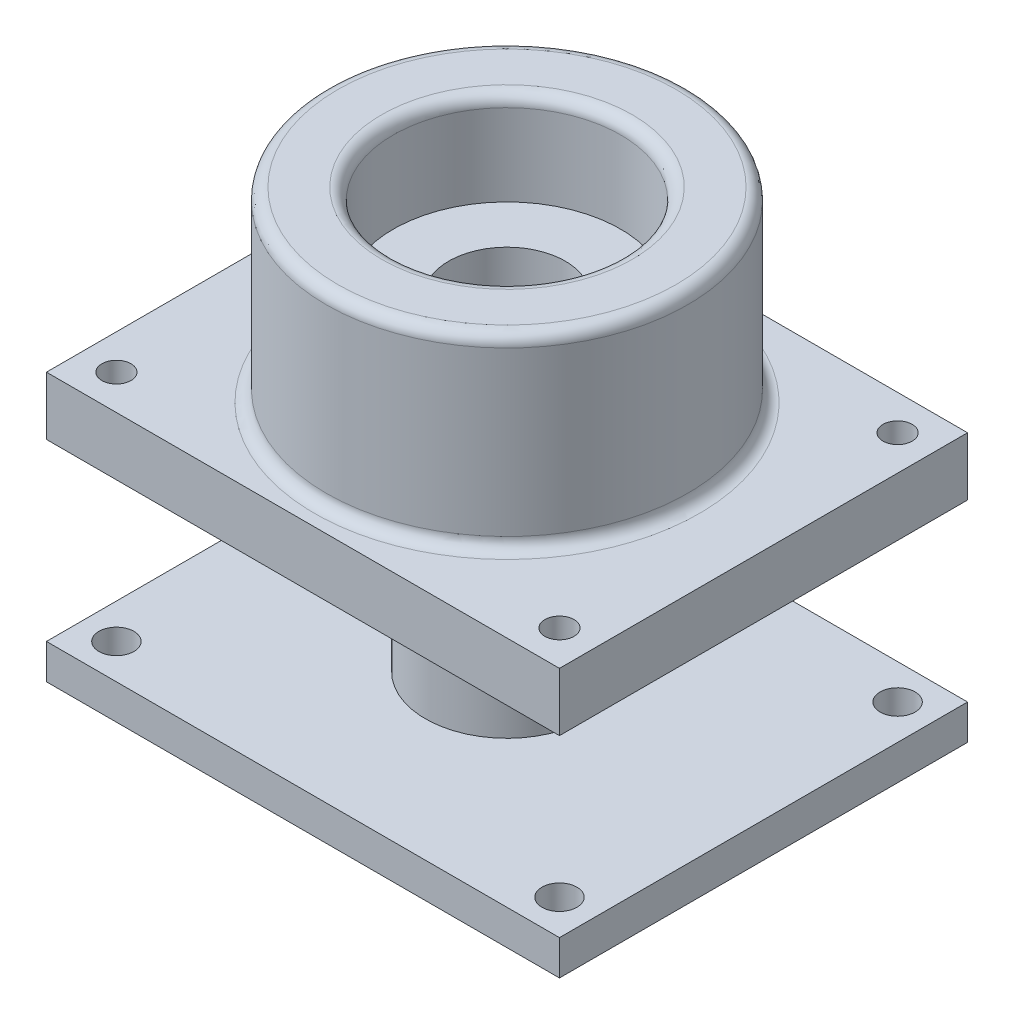
ISO-10303-21;
HEADER;
FILE_DESCRIPTION(('STEP AP214'),'2;1');
FILE_NAME('part.step','',(''),(''),'','','');
FILE_SCHEMA(('AUTOMOTIVE_DESIGN { 1 0 10303 214 1 1 1 1 }'));
ENDSEC;
DATA;
#1=APPLICATION_CONTEXT('core data for automotive mechanical design processes');
#2=APPLICATION_PROTOCOL_DEFINITION('international standard','automotive_design',2000,#1);
#3=PRODUCT_CONTEXT('',#1,'mechanical');
#4=PRODUCT('Part','Part','',(#3));
#5=PRODUCT_RELATED_PRODUCT_CATEGORY('part','',(#4));
#6=PRODUCT_DEFINITION_FORMATION('','',#4);
#7=PRODUCT_DEFINITION_CONTEXT('part definition',#1,'design');
#8=PRODUCT_DEFINITION('design','',#6,#7);
#9=PRODUCT_DEFINITION_SHAPE('','',#8);
#10=(LENGTH_UNIT() NAMED_UNIT(*) SI_UNIT(.MILLI.,.METRE.));
#11=(NAMED_UNIT(*) PLANE_ANGLE_UNIT() SI_UNIT($,.RADIAN.));
#12=(NAMED_UNIT(*) SI_UNIT($,.STERADIAN.) SOLID_ANGLE_UNIT());
#13=UNCERTAINTY_MEASURE_WITH_UNIT(LENGTH_MEASURE(1.E-05),#10,'distance_accuracy_value','');
#14=(GEOMETRIC_REPRESENTATION_CONTEXT(3) GLOBAL_UNCERTAINTY_ASSIGNED_CONTEXT((#13)) GLOBAL_UNIT_ASSIGNED_CONTEXT((#10,
#11,#12)) REPRESENTATION_CONTEXT('',''));
#15=CARTESIAN_POINT('',(0.,0.,0.));
#16=DIRECTION('',(0.,0.,1.));
#17=DIRECTION('',(1.,0.,0.));
#18=AXIS2_PLACEMENT_3D('',#15,#16,#17);
#19=CARTESIAN_POINT('',(0.,16.,0.));
#20=DIRECTION('',(0.,-1.,0.));
#21=DIRECTION('',(0.,0.,-1.));
#22=AXIS2_PLACEMENT_3D('',#19,#20,#21);
#23=CYLINDRICAL_SURFACE('',#22,15.5);
#24=CARTESIAN_POINT('',(0.,15.,0.));
#25=DIRECTION('',(0.,1.,0.));
#26=DIRECTION('',(0.,0.,1.));
#27=AXIS2_PLACEMENT_3D('',#24,#25,#26);
#28=CIRCLE('',#27,15.5);
#29=CARTESIAN_POINT('',(0.,15.,15.5));
#30=VERTEX_POINT('',#29);
#31=EDGE_CURVE('E11',#30,#30,#28,.F.);
#32=ORIENTED_EDGE('',*,*,#31,.T.);
#33=EDGE_LOOP('',(#32));
#34=FACE_BOUND('',#33,.T.);
#35=CARTESIAN_POINT('',(0.,1.,0.));
#36=DIRECTION('',(0.,-1.,0.));
#37=DIRECTION('',(0.,0.,-1.));
#38=AXIS2_PLACEMENT_3D('',#35,#36,#37);
#39=CIRCLE('',#38,15.5);
#40=CARTESIAN_POINT('',(0.,1.,-15.5));
#41=VERTEX_POINT('',#40);
#42=EDGE_CURVE('E210',#41,#41,#39,.F.);
#43=ORIENTED_EDGE('',*,*,#42,.T.);
#44=EDGE_LOOP('',(#43));
#45=FACE_BOUND('',#44,.T.);
#46=ADVANCED_FACE('F35',(#34,#45),#23,.T.);
#47=CARTESIAN_POINT('',(0.,16.,0.));
#48=DIRECTION('',(0.,1.,0.));
#49=DIRECTION('',(0.,0.,1.));
#50=AXIS2_PLACEMENT_3D('',#47,#48,#49);
#51=PLANE('',#50);
#52=CARTESIAN_POINT('',(0.,16.,0.));
#53=DIRECTION('',(0.,1.,0.));
#54=DIRECTION('',(0.,0.,1.));
#55=AXIS2_PLACEMENT_3D('',#52,#53,#54);
#56=CIRCLE('',#55,14.5);
#57=CARTESIAN_POINT('',(0.,16.,14.5));
#58=VERTEX_POINT('',#57);
#59=EDGE_CURVE('E45',#58,#58,#56,.T.);
#60=ORIENTED_EDGE('',*,*,#59,.T.);
#61=EDGE_LOOP('',(#60));
#62=FACE_BOUND('',#61,.T.);
#63=CARTESIAN_POINT('',(0.,16.,0.));
#64=DIRECTION('',(0.,1.,0.));
#65=DIRECTION('',(0.,0.,1.));
#66=AXIS2_PLACEMENT_3D('',#63,#64,#65);
#67=CIRCLE('',#66,10.75);
#68=CARTESIAN_POINT('',(0.,16.,10.75));
#69=VERTEX_POINT('',#68);
#70=EDGE_CURVE('E219',#69,#69,#67,.F.);
#71=ORIENTED_EDGE('',*,*,#70,.T.);
#72=EDGE_LOOP('',(#71));
#73=FACE_BOUND('',#72,.T.);
#74=ADVANCED_FACE('F258',(#62,#73),#51,.T.);
#75=CARTESIAN_POINT('',(0.,-5.,0.));
#76=DIRECTION('',(0.,-1.,0.));
#77=DIRECTION('',(0.,0.,-1.));
#78=AXIS2_PLACEMENT_3D('',#75,#76,#77);
#79=PLANE('',#78);
#80=CARTESIAN_POINT('',(0.,-5.,0.));
#81=DIRECTION('',(0.,-1.,0.));
#82=DIRECTION('',(0.,0.,-1.));
#83=AXIS2_PLACEMENT_3D('',#80,#81,#82);
#84=CIRCLE('',#83,7.);
#85=CARTESIAN_POINT('',(0.,-5.,-7.));
#86=VERTEX_POINT('',#85);
#87=EDGE_CURVE('E164',#86,#86,#84,.F.);
#88=ORIENTED_EDGE('',*,*,#87,.T.);
#89=EDGE_LOOP('',(#88));
#90=FACE_BOUND('',#89,.T.);
#91=CARTESIAN_POINT('',(-19.0000000000001,-5.,14.5));
#92=DIRECTION('',(0.,-1.,0.));
#93=DIRECTION('',(0.,0.,-1.));
#94=AXIS2_PLACEMENT_3D('',#91,#92,#93);
#95=CIRCLE('',#94,1.25);
#96=CARTESIAN_POINT('',(-19.0000000000001,-5.,13.25));
#97=VERTEX_POINT('',#96);
#98=EDGE_CURVE('E172',#97,#97,#95,.T.);
#99=ORIENTED_EDGE('',*,*,#98,.F.);
#100=EDGE_LOOP('',(#99));
#101=FACE_BOUND('',#100,.T.);
#102=CARTESIAN_POINT('',(18.9999999999999,-5.,14.5));
#103=DIRECTION('',(0.,-1.,0.));
#104=DIRECTION('',(0.,0.,-1.));
#105=AXIS2_PLACEMENT_3D('',#102,#103,#104);
#106=CIRCLE('',#105,1.25);
#107=CARTESIAN_POINT('',(18.9999999999999,-5.,13.25));
#108=VERTEX_POINT('',#107);
#109=EDGE_CURVE('E184',#108,#108,#106,.T.);
#110=ORIENTED_EDGE('',*,*,#109,.F.);
#111=EDGE_LOOP('',(#110));
#112=FACE_BOUND('',#111,.T.);
#113=DIRECTION('',(0.,0.,1.));
#114=VECTOR('',#113,1.);
#115=CARTESIAN_POINT('',(22.,-5.,17.5));
#116=LINE('',#115,#114);
#117=CARTESIAN_POINT('',(22.,-5.,-17.5));
#118=VERTEX_POINT('',#117);
#119=CARTESIAN_POINT('',(22.,-5.,17.5));
#120=VERTEX_POINT('',#119);
#121=EDGE_CURVE('E190',#118,#120,#116,.T.);
#122=ORIENTED_EDGE('',*,*,#121,.T.);
#123=DIRECTION('',(-1.,0.,0.));
#124=VECTOR('',#123,1.);
#125=CARTESIAN_POINT('',(-22.,-5.,17.5));
#126=LINE('',#125,#124);
#127=CARTESIAN_POINT('',(-22.,-5.,17.5));
#128=VERTEX_POINT('',#127);
#129=EDGE_CURVE('E86',#120,#128,#126,.T.);
#130=ORIENTED_EDGE('',*,*,#129,.T.);
#131=DIRECTION('',(0.,0.,-1.));
#132=VECTOR('',#131,1.);
#133=CARTESIAN_POINT('',(-22.,-5.,17.5));
#134=LINE('',#133,#132);
#135=CARTESIAN_POINT('',(-22.,-5.,-17.5));
#136=VERTEX_POINT('',#135);
#137=EDGE_CURVE('E193',#128,#136,#134,.T.);
#138=ORIENTED_EDGE('',*,*,#137,.T.);
#139=DIRECTION('',(1.,0.,0.));
#140=VECTOR('',#139,1.);
#141=CARTESIAN_POINT('',(-22.,-5.,-17.5));
#142=LINE('',#141,#140);
#143=EDGE_CURVE('E54',#136,#118,#142,.T.);
#144=ORIENTED_EDGE('',*,*,#143,.T.);
#145=EDGE_LOOP('',(#122,#130,#138,#144));
#146=FACE_BOUND('',#145,.T.);
#147=CARTESIAN_POINT('',(19.0000000000002,-5.,-14.5));
#148=DIRECTION('',(0.,-1.,0.));
#149=DIRECTION('',(0.,0.,-1.));
#150=AXIS2_PLACEMENT_3D('',#147,#148,#149);
#151=CIRCLE('',#150,1.25);
#152=CARTESIAN_POINT('',(19.0000000000002,-5.,-15.75));
#153=VERTEX_POINT('',#152);
#154=EDGE_CURVE('E178',#153,#153,#151,.T.);
#155=ORIENTED_EDGE('',*,*,#154,.F.);
#156=EDGE_LOOP('',(#155));
#157=FACE_BOUND('',#156,.T.);
#158=CARTESIAN_POINT('',(-18.9999999999998,-5.,-14.5));
#159=DIRECTION('',(0.,-1.,0.));
#160=DIRECTION('',(0.,0.,-1.));
#161=AXIS2_PLACEMENT_3D('',#158,#159,#160);
#162=CIRCLE('',#161,1.25);
#163=CARTESIAN_POINT('',(-18.9999999999998,-5.,-15.75));
#164=VERTEX_POINT('',#163);
#165=EDGE_CURVE('E165',#164,#164,#162,.T.);
#166=ORIENTED_EDGE('',*,*,#165,.F.);
#167=EDGE_LOOP('',(#166));
#168=FACE_BOUND('',#167,.T.);
#169=ADVANCED_FACE('F226',(#90,#101,#112,#146,#157,#168),#79,.T.);
#170=CARTESIAN_POINT('',(0.,0.,0.));
#171=DIRECTION('',(0.,-1.,0.));
#172=DIRECTION('',(0.,0.,-1.));
#173=AXIS2_PLACEMENT_3D('',#170,#171,#172);
#174=PLANE('',#173);
#175=CARTESIAN_POINT('',(0.,0.,0.));
#176=DIRECTION('',(0.,-1.,0.));
#177=DIRECTION('',(0.,0.,-1.));
#178=AXIS2_PLACEMENT_3D('',#175,#176,#177);
#179=CIRCLE('',#178,16.5);
#180=CARTESIAN_POINT('',(0.,0.,-16.5));
#181=VERTEX_POINT('',#180);
#182=EDGE_CURVE('E213',#181,#181,#179,.T.);
#183=ORIENTED_EDGE('',*,*,#182,.T.);
#184=EDGE_LOOP('',(#183));
#185=FACE_BOUND('',#184,.T.);
#186=DIRECTION('',(0.,0.,1.));
#187=VECTOR('',#186,1.);
#188=CARTESIAN_POINT('',(22.,0.,17.5));
#189=LINE('',#188,#187);
#190=CARTESIAN_POINT('',(22.,0.,-17.5));
#191=VERTEX_POINT('',#190);
#192=CARTESIAN_POINT('',(22.,0.,17.5));
#193=VERTEX_POINT('',#192);
#194=EDGE_CURVE('E187',#191,#193,#189,.T.);
#195=ORIENTED_EDGE('',*,*,#194,.F.);
#196=DIRECTION('',(1.,0.,0.));
#197=VECTOR('',#196,1.);
#198=CARTESIAN_POINT('',(-22.,0.,-17.5));
#199=LINE('',#198,#197);
#200=CARTESIAN_POINT('',(-22.,0.,-17.5));
#201=VERTEX_POINT('',#200);
#202=EDGE_CURVE('E78',#201,#191,#199,.T.);
#203=ORIENTED_EDGE('',*,*,#202,.F.);
#204=DIRECTION('',(0.,0.,-1.));
#205=VECTOR('',#204,1.);
#206=CARTESIAN_POINT('',(-22.,0.,17.5));
#207=LINE('',#206,#205);
#208=CARTESIAN_POINT('',(-22.,0.,17.5));
#209=VERTEX_POINT('',#208);
#210=EDGE_CURVE('E72',#209,#201,#207,.T.);
#211=ORIENTED_EDGE('',*,*,#210,.F.);
#212=DIRECTION('',(-1.,0.,0.));
#213=VECTOR('',#212,1.);
#214=CARTESIAN_POINT('',(-22.,0.,17.5));
#215=LINE('',#214,#213);
#216=EDGE_CURVE('E199',#193,#209,#215,.T.);
#217=ORIENTED_EDGE('',*,*,#216,.F.);
#218=EDGE_LOOP('',(#195,#203,#211,#217));
#219=FACE_BOUND('',#218,.T.);
#220=CARTESIAN_POINT('',(18.9999999999999,0.,14.5));
#221=DIRECTION('',(0.,-1.,0.));
#222=DIRECTION('',(0.,0.,-1.));
#223=AXIS2_PLACEMENT_3D('',#220,#221,#222);
#224=CIRCLE('',#223,1.25);
#225=CARTESIAN_POINT('',(18.9999999999999,0.,13.25));
#226=VERTEX_POINT('',#225);
#227=EDGE_CURVE('E181',#226,#226,#224,.T.);
#228=ORIENTED_EDGE('',*,*,#227,.T.);
#229=EDGE_LOOP('',(#228));
#230=FACE_BOUND('',#229,.T.);
#231=CARTESIAN_POINT('',(19.0000000000002,0.,-14.5));
#232=DIRECTION('',(0.,-1.,0.));
#233=DIRECTION('',(0.,0.,-1.));
#234=AXIS2_PLACEMENT_3D('',#231,#232,#233);
#235=CIRCLE('',#234,1.25);
#236=CARTESIAN_POINT('',(19.0000000000002,0.,-15.75));
#237=VERTEX_POINT('',#236);
#238=EDGE_CURVE('E175',#237,#237,#235,.T.);
#239=ORIENTED_EDGE('',*,*,#238,.T.);
#240=EDGE_LOOP('',(#239));
#241=FACE_BOUND('',#240,.T.);
#242=CARTESIAN_POINT('',(-19.0000000000001,0.,14.5));
#243=DIRECTION('',(0.,-1.,0.));
#244=DIRECTION('',(0.,0.,-1.));
#245=AXIS2_PLACEMENT_3D('',#242,#243,#244);
#246=CIRCLE('',#245,1.25);
#247=CARTESIAN_POINT('',(-19.0000000000001,0.,13.25));
#248=VERTEX_POINT('',#247);
#249=EDGE_CURVE('E168',#248,#248,#246,.T.);
#250=ORIENTED_EDGE('',*,*,#249,.T.);
#251=EDGE_LOOP('',(#250));
#252=FACE_BOUND('',#251,.T.);
#253=CARTESIAN_POINT('',(-18.9999999999998,0.,-14.5));
#254=DIRECTION('',(0.,-1.,0.));
#255=DIRECTION('',(0.,0.,-1.));
#256=AXIS2_PLACEMENT_3D('',#253,#254,#255);
#257=CIRCLE('',#256,1.25);
#258=CARTESIAN_POINT('',(-18.9999999999998,0.,-15.75));
#259=VERTEX_POINT('',#258);
#260=EDGE_CURVE('E169',#259,#259,#257,.T.);
#261=ORIENTED_EDGE('',*,*,#260,.T.);
#262=EDGE_LOOP('',(#261));
#263=FACE_BOUND('',#262,.T.);
#264=ADVANCED_FACE('F455',(#185,#219,#230,#241,#252,#263),#174,.F.);
#265=CARTESIAN_POINT('',(22.,-5.,17.5));
#266=DIRECTION('',(-1.,0.,0.));
#267=DIRECTION('',(0.,0.,1.));
#268=AXIS2_PLACEMENT_3D('',#265,#266,#267);
#269=PLANE('',#268);
#270=ORIENTED_EDGE('',*,*,#194,.T.);
#271=DIRECTION('',(0.,1.,0.));
#272=VECTOR('',#271,1.);
#273=CARTESIAN_POINT('',(22.,-5.,17.5));
#274=LINE('',#273,#272);
#275=EDGE_CURVE('E208',#120,#193,#274,.T.);
#276=ORIENTED_EDGE('',*,*,#275,.F.);
#277=ORIENTED_EDGE('',*,*,#121,.F.);
#278=DIRECTION('',(0.,1.,0.));
#279=VECTOR('',#278,1.);
#280=CARTESIAN_POINT('',(22.,-5.,-17.5));
#281=LINE('',#280,#279);
#282=EDGE_CURVE('E196',#118,#191,#281,.T.);
#283=ORIENTED_EDGE('',*,*,#282,.T.);
#284=EDGE_LOOP('',(#270,#276,#277,#283));
#285=FACE_BOUND('',#284,.T.);
#286=ADVANCED_FACE('F489',(#285),#269,.F.);
#287=CARTESIAN_POINT('',(-22.,-5.,17.5));
#288=DIRECTION('',(0.,0.,-1.));
#289=DIRECTION('',(-1.,0.,0.));
#290=AXIS2_PLACEMENT_3D('',#287,#288,#289);
#291=PLANE('',#290);
#292=ORIENTED_EDGE('',*,*,#216,.T.);
#293=DIRECTION('',(0.,1.,0.));
#294=VECTOR('',#293,1.);
#295=CARTESIAN_POINT('',(-22.,-5.,17.5));
#296=LINE('',#295,#294);
#297=EDGE_CURVE('E206',#128,#209,#296,.T.);
#298=ORIENTED_EDGE('',*,*,#297,.F.);
#299=ORIENTED_EDGE('',*,*,#129,.F.);
#300=ORIENTED_EDGE('',*,*,#275,.T.);
#301=EDGE_LOOP('',(#292,#298,#299,#300));
#302=FACE_BOUND('',#301,.T.);
#303=ADVANCED_FACE('F549',(#302),#291,.F.);
#304=CARTESIAN_POINT('',(-22.,-5.,17.5));
#305=DIRECTION('',(1.,0.,0.));
#306=DIRECTION('',(0.,0.,-1.));
#307=AXIS2_PLACEMENT_3D('',#304,#305,#306);
#308=PLANE('',#307);
#309=ORIENTED_EDGE('',*,*,#210,.T.);
#310=DIRECTION('',(0.,1.,0.));
#311=VECTOR('',#310,1.);
#312=CARTESIAN_POINT('',(-22.,-5.,-17.5));
#313=LINE('',#312,#311);
#314=EDGE_CURVE('E204',#136,#201,#313,.T.);
#315=ORIENTED_EDGE('',*,*,#314,.F.);
#316=ORIENTED_EDGE('',*,*,#137,.F.);
#317=ORIENTED_EDGE('',*,*,#297,.T.);
#318=EDGE_LOOP('',(#309,#315,#316,#317));
#319=FACE_BOUND('',#318,.T.);
#320=ADVANCED_FACE('F540',(#319),#308,.F.);
#321=CARTESIAN_POINT('',(-22.,-5.,-17.5));
#322=DIRECTION('',(0.,0.,1.));
#323=DIRECTION('',(1.,0.,0.));
#324=AXIS2_PLACEMENT_3D('',#321,#322,#323);
#325=PLANE('',#324);
#326=ORIENTED_EDGE('',*,*,#202,.T.);
#327=ORIENTED_EDGE('',*,*,#282,.F.);
#328=ORIENTED_EDGE('',*,*,#143,.F.);
#329=ORIENTED_EDGE('',*,*,#314,.T.);
#330=EDGE_LOOP('',(#326,#327,#328,#329));
#331=FACE_BOUND('',#330,.T.);
#332=ADVANCED_FACE('F530',(#331),#325,.F.);
#333=CARTESIAN_POINT('',(18.9999999999999,-5.,14.5));
#334=DIRECTION('',(0.,1.,0.));
#335=DIRECTION('',(0.,0.,1.));
#336=AXIS2_PLACEMENT_3D('',#333,#334,#335);
#337=CYLINDRICAL_SURFACE('',#336,1.25);
#338=ORIENTED_EDGE('',*,*,#109,.T.);
#339=EDGE_LOOP('',(#338));
#340=FACE_BOUND('',#339,.T.);
#341=ORIENTED_EDGE('',*,*,#227,.F.);
#342=EDGE_LOOP('',(#341));
#343=FACE_BOUND('',#342,.T.);
#344=ADVANCED_FACE('F520',(#340,#343),#337,.F.);
#345=CARTESIAN_POINT('',(19.0000000000002,-5.,-14.5));
#346=DIRECTION('',(0.,1.,0.));
#347=DIRECTION('',(0.,0.,1.));
#348=AXIS2_PLACEMENT_3D('',#345,#346,#347);
#349=CYLINDRICAL_SURFACE('',#348,1.25);
#350=ORIENTED_EDGE('',*,*,#154,.T.);
#351=EDGE_LOOP('',(#350));
#352=FACE_BOUND('',#351,.T.);
#353=ORIENTED_EDGE('',*,*,#238,.F.);
#354=EDGE_LOOP('',(#353));
#355=FACE_BOUND('',#354,.T.);
#356=ADVANCED_FACE('F510',(#352,#355),#349,.F.);
#357=CARTESIAN_POINT('',(-19.0000000000001,-5.,14.5));
#358=DIRECTION('',(0.,1.,0.));
#359=DIRECTION('',(0.,0.,1.));
#360=AXIS2_PLACEMENT_3D('',#357,#358,#359);
#361=CYLINDRICAL_SURFACE('',#360,1.25);
#362=ORIENTED_EDGE('',*,*,#98,.T.);
#363=EDGE_LOOP('',(#362));
#364=FACE_BOUND('',#363,.T.);
#365=ORIENTED_EDGE('',*,*,#249,.F.);
#366=EDGE_LOOP('',(#365));
#367=FACE_BOUND('',#366,.T.);
#368=ADVANCED_FACE('F500',(#364,#367),#361,.F.);
#369=CARTESIAN_POINT('',(-18.9999999999998,-5.,-14.5));
#370=DIRECTION('',(0.,1.,0.));
#371=DIRECTION('',(0.,0.,1.));
#372=AXIS2_PLACEMENT_3D('',#369,#370,#371);
#373=CYLINDRICAL_SURFACE('',#372,1.25);
#374=ORIENTED_EDGE('',*,*,#165,.T.);
#375=EDGE_LOOP('',(#374));
#376=FACE_BOUND('',#375,.T.);
#377=ORIENTED_EDGE('',*,*,#260,.F.);
#378=EDGE_LOOP('',(#377));
#379=FACE_BOUND('',#378,.T.);
#380=ADVANCED_FACE('F286',(#376,#379),#373,.F.);
#381=CARTESIAN_POINT('',(0.,10.,0.));
#382=DIRECTION('',(0.,1.,0.));
#383=DIRECTION('',(0.,0.,1.));
#384=AXIS2_PLACEMENT_3D('',#381,#382,#383);
#385=CYLINDRICAL_SURFACE('',#384,9.75);
#386=CARTESIAN_POINT('',(0.,15.,0.));
#387=DIRECTION('',(0.,1.,0.));
#388=DIRECTION('',(0.,0.,1.));
#389=AXIS2_PLACEMENT_3D('',#386,#387,#388);
#390=CIRCLE('',#389,9.75);
#391=CARTESIAN_POINT('',(0.,15.,9.75));
#392=VERTEX_POINT('',#391);
#393=EDGE_CURVE('E216',#392,#392,#390,.T.);
#394=ORIENTED_EDGE('',*,*,#393,.T.);
#395=EDGE_LOOP('',(#394));
#396=FACE_BOUND('',#395,.T.);
#397=CARTESIAN_POINT('',(0.,8.,0.));
#398=DIRECTION('',(0.,1.,0.));
#399=DIRECTION('',(0.,0.,1.));
#400=AXIS2_PLACEMENT_3D('',#397,#398,#399);
#401=CIRCLE('',#400,9.75);
#402=CARTESIAN_POINT('',(0.,8.,9.75));
#403=VERTEX_POINT('',#402);
#404=EDGE_CURVE('E154',#403,#403,#401,.T.);
#405=ORIENTED_EDGE('',*,*,#404,.F.);
#406=EDGE_LOOP('',(#405));
#407=FACE_BOUND('',#406,.T.);
#408=ADVANCED_FACE('F272',(#396,#407),#385,.F.);
#409=CARTESIAN_POINT('',(0.,1.,0.));
#410=DIRECTION('',(0.,-1.,0.));
#411=DIRECTION('',(0.,0.,-1.));
#412=AXIS2_PLACEMENT_3D('',#409,#410,#411);
#413=TOROIDAL_SURFACE('',#412,16.5,1.);
#414=ORIENTED_EDGE('',*,*,#182,.F.);
#415=EDGE_LOOP('',(#414));
#416=FACE_BOUND('',#415,.T.);
#417=ORIENTED_EDGE('',*,*,#42,.F.);
#418=EDGE_LOOP('',(#417));
#419=FACE_BOUND('',#418,.T.);
#420=ADVANCED_FACE('F269',(#416,#419),#413,.F.);
#421=CARTESIAN_POINT('',(0.,15.,0.));
#422=DIRECTION('',(0.,1.,0.));
#423=DIRECTION('',(0.,0.,1.));
#424=AXIS2_PLACEMENT_3D('',#421,#422,#423);
#425=TOROIDAL_SURFACE('',#424,10.75,1.);
#426=ORIENTED_EDGE('',*,*,#70,.F.);
#427=EDGE_LOOP('',(#426));
#428=FACE_BOUND('',#427,.T.);
#429=ORIENTED_EDGE('',*,*,#393,.F.);
#430=EDGE_LOOP('',(#429));
#431=FACE_BOUND('',#430,.T.);
#432=ADVANCED_FACE('F271',(#428,#431),#425,.T.);
#433=CARTESIAN_POINT('',(0.,15.,0.));
#434=DIRECTION('',(0.,1.,0.));
#435=DIRECTION('',(0.,0.,1.));
#436=AXIS2_PLACEMENT_3D('',#433,#434,#435);
#437=TOROIDAL_SURFACE('',#436,14.5,1.);
#438=ORIENTED_EDGE('',*,*,#31,.F.);
#439=EDGE_LOOP('',(#438));
#440=FACE_BOUND('',#439,.T.);
#441=ORIENTED_EDGE('',*,*,#59,.F.);
#442=EDGE_LOOP('',(#441));
#443=FACE_BOUND('',#442,.T.);
#444=ADVANCED_FACE('F37',(#440,#443),#437,.T.);
#445=CARTESIAN_POINT('',(0.,-20.,0.));
#446=DIRECTION('',(0.,1.,0.));
#447=DIRECTION('',(0.,0.,1.));
#448=AXIS2_PLACEMENT_3D('',#445,#446,#447);
#449=CYLINDRICAL_SURFACE('',#448,7.);
#450=ORIENTED_EDGE('',*,*,#87,.F.);
#451=EDGE_LOOP('',(#450));
#452=FACE_BOUND('',#451,.T.);
#453=CARTESIAN_POINT('',(0.,-20.,0.));
#454=DIRECTION('',(0.,-1.,0.));
#455=DIRECTION('',(0.,0.,-1.));
#456=AXIS2_PLACEMENT_3D('',#453,#454,#455);
#457=CIRCLE('',#456,7.);
#458=CARTESIAN_POINT('',(0.,-20.,-7.));
#459=VERTEX_POINT('',#458);
#460=EDGE_CURVE('E161',#459,#459,#457,.T.);
#461=ORIENTED_EDGE('',*,*,#460,.F.);
#462=EDGE_LOOP('',(#461));
#463=FACE_BOUND('',#462,.T.);
#464=ADVANCED_FACE('F229',(#452,#463),#449,.T.);
#465=CARTESIAN_POINT('',(0.,8.,0.));
#466=DIRECTION('',(0.,1.,0.));
#467=DIRECTION('',(0.,0.,1.));
#468=AXIS2_PLACEMENT_3D('',#465,#466,#467);
#469=PLANE('',#468);
#470=ORIENTED_EDGE('',*,*,#404,.T.);
#471=EDGE_LOOP('',(#470));
#472=FACE_BOUND('',#471,.T.);
#473=CARTESIAN_POINT('',(0.,8.,0.));
#474=DIRECTION('',(0.,1.,0.));
#475=DIRECTION('',(0.,0.,1.));
#476=AXIS2_PLACEMENT_3D('',#473,#474,#475);
#477=CIRCLE('',#476,5.);
#478=CARTESIAN_POINT('',(0.,8.,5.));
#479=VERTEX_POINT('',#478);
#480=EDGE_CURVE('E39',#479,#479,#477,.F.);
#481=ORIENTED_EDGE('',*,*,#480,.T.);
#482=EDGE_LOOP('',(#481));
#483=FACE_BOUND('',#482,.T.);
#484=ADVANCED_FACE('F232',(#472,#483),#469,.T.);
#485=CARTESIAN_POINT('',(0.,-9.,0.));
#486=DIRECTION('',(0.,1.,0.));
#487=DIRECTION('',(0.,0.,1.));
#488=AXIS2_PLACEMENT_3D('',#485,#486,#487);
#489=CYLINDRICAL_SURFACE('',#488,5.);
#490=ORIENTED_EDGE('',*,*,#480,.F.);
#491=EDGE_LOOP('',(#490));
#492=FACE_BOUND('',#491,.T.);
#493=CARTESIAN_POINT('',(0.,-23.,0.));
#494=DIRECTION('',(0.,-1.,0.));
#495=DIRECTION('',(0.,0.,-1.));
#496=AXIS2_PLACEMENT_3D('',#493,#494,#495);
#497=CIRCLE('',#496,5.);
#498=CARTESIAN_POINT('',(0.,-23.,-5.));
#499=VERTEX_POINT('',#498);
#500=EDGE_CURVE('E301',#499,#499,#497,.T.);
#501=ORIENTED_EDGE('',*,*,#500,.T.);
#502=EDGE_LOOP('',(#501));
#503=FACE_BOUND('',#502,.T.);
#504=ADVANCED_FACE('F239',(#492,#503),#489,.F.);
#505=CARTESIAN_POINT('',(0.,-20.,0.));
#506=DIRECTION('',(0.,1.,0.));
#507=DIRECTION('',(0.,0.,1.));
#508=AXIS2_PLACEMENT_3D('',#505,#506,#507);
#509=PLANE('',#508);
#510=CARTESIAN_POINT('',(19.0000000000001,-20.,-14.5));
#511=DIRECTION('',(0.,-1.,0.));
#512=DIRECTION('',(0.,0.,-1.));
#513=AXIS2_PLACEMENT_3D('',#510,#511,#512);
#514=CIRCLE('',#513,1.5);
#515=CARTESIAN_POINT('',(19.0000000000001,-20.,-16.));
#516=VERTEX_POINT('',#515);
#517=EDGE_CURVE('E303',#516,#516,#514,.T.);
#518=ORIENTED_EDGE('',*,*,#517,.T.);
#519=EDGE_LOOP('',(#518));
#520=FACE_BOUND('',#519,.T.);
#521=CARTESIAN_POINT('',(-18.9999999999999,-20.,-14.5));
#522=DIRECTION('',(0.,-1.,0.));
#523=DIRECTION('',(0.,0.,-1.));
#524=AXIS2_PLACEMENT_3D('',#521,#522,#523);
#525=CIRCLE('',#524,1.5);
#526=CARTESIAN_POINT('',(-18.9999999999999,-20.,-16.));
#527=VERTEX_POINT('',#526);
#528=EDGE_CURVE('E318',#527,#527,#525,.T.);
#529=ORIENTED_EDGE('',*,*,#528,.T.);
#530=EDGE_LOOP('',(#529));
#531=FACE_BOUND('',#530,.T.);
#532=CARTESIAN_POINT('',(-19.,-20.,14.5));
#533=DIRECTION('',(0.,-1.,0.));
#534=DIRECTION('',(0.,0.,-1.));
#535=AXIS2_PLACEMENT_3D('',#532,#533,#534);
#536=CIRCLE('',#535,1.5);
#537=CARTESIAN_POINT('',(-19.,-20.,13.));
#538=VERTEX_POINT('',#537);
#539=EDGE_CURVE('E312',#538,#538,#536,.T.);
#540=ORIENTED_EDGE('',*,*,#539,.T.);
#541=EDGE_LOOP('',(#540));
#542=FACE_BOUND('',#541,.T.);
#543=CARTESIAN_POINT('',(19.,-20.,14.5));
#544=DIRECTION('',(0.,-1.,0.));
#545=DIRECTION('',(0.,0.,-1.));
#546=AXIS2_PLACEMENT_3D('',#543,#544,#545);
#547=CIRCLE('',#546,1.5);
#548=CARTESIAN_POINT('',(19.,-20.,13.));
#549=VERTEX_POINT('',#548);
#550=EDGE_CURVE('E142',#549,#549,#547,.T.);
#551=ORIENTED_EDGE('',*,*,#550,.T.);
#552=EDGE_LOOP('',(#551));
#553=FACE_BOUND('',#552,.T.);
#554=ORIENTED_EDGE('',*,*,#460,.T.);
#555=EDGE_LOOP('',(#554));
#556=FACE_BOUND('',#555,.T.);
#557=DIRECTION('',(-1.,0.,0.));
#558=VECTOR('',#557,1.);
#559=CARTESIAN_POINT('',(22.,-20.,-17.5));
#560=LINE('',#559,#558);
#561=CARTESIAN_POINT('',(22.,-20.,-17.5));
#562=VERTEX_POINT('',#561);
#563=CARTESIAN_POINT('',(-22.,-20.,-17.5));
#564=VERTEX_POINT('',#563);
#565=EDGE_CURVE('E147',#562,#564,#560,.T.);
#566=ORIENTED_EDGE('',*,*,#565,.T.);
#567=DIRECTION('',(0.,0.,1.));
#568=VECTOR('',#567,1.);
#569=CARTESIAN_POINT('',(-22.,-20.,-17.5));
#570=LINE('',#569,#568);
#571=CARTESIAN_POINT('',(-22.,-20.,17.5));
#572=VERTEX_POINT('',#571);
#573=EDGE_CURVE('E118',#564,#572,#570,.T.);
#574=ORIENTED_EDGE('',*,*,#573,.T.);
#575=DIRECTION('',(-1.,0.,0.));
#576=VECTOR('',#575,1.);
#577=CARTESIAN_POINT('',(22.,-20.,17.5));
#578=LINE('',#577,#576);
#579=CARTESIAN_POINT('',(22.,-20.,17.5));
#580=VERTEX_POINT('',#579);
#581=EDGE_CURVE('E139',#580,#572,#578,.T.);
#582=ORIENTED_EDGE('',*,*,#581,.F.);
#583=DIRECTION('',(0.,0.,1.));
#584=VECTOR('',#583,1.);
#585=CARTESIAN_POINT('',(22.,-20.,-17.5));
#586=LINE('',#585,#584);
#587=EDGE_CURVE('E137',#562,#580,#586,.T.);
#588=ORIENTED_EDGE('',*,*,#587,.F.);
#589=EDGE_LOOP('',(#566,#574,#582,#588));
#590=FACE_BOUND('',#589,.T.);
#591=ADVANCED_FACE('F236',(#520,#531,#542,#553,#556,#590),#509,.T.);
#592=CARTESIAN_POINT('',(0.,-23.,0.));
#593=DIRECTION('',(0.,1.,0.));
#594=DIRECTION('',(0.,0.,1.));
#595=AXIS2_PLACEMENT_3D('',#592,#593,#594);
#596=PLANE('',#595);
#597=ORIENTED_EDGE('',*,*,#500,.F.);
#598=EDGE_LOOP('',(#597));
#599=FACE_BOUND('',#598,.T.);
#600=CARTESIAN_POINT('',(19.0000000000001,-23.,-14.5));
#601=DIRECTION('',(0.,-1.,0.));
#602=DIRECTION('',(0.,0.,-1.));
#603=AXIS2_PLACEMENT_3D('',#600,#601,#602);
#604=CIRCLE('',#603,1.5);
#605=CARTESIAN_POINT('',(19.0000000000001,-23.,-16.));
#606=VERTEX_POINT('',#605);
#607=EDGE_CURVE('E306',#606,#606,#604,.T.);
#608=ORIENTED_EDGE('',*,*,#607,.F.);
#609=EDGE_LOOP('',(#608));
#610=FACE_BOUND('',#609,.T.);
#611=CARTESIAN_POINT('',(-18.9999999999999,-23.,-14.5));
#612=DIRECTION('',(0.,-1.,0.));
#613=DIRECTION('',(0.,0.,-1.));
#614=AXIS2_PLACEMENT_3D('',#611,#612,#613);
#615=CIRCLE('',#614,1.5);
#616=CARTESIAN_POINT('',(-18.9999999999999,-23.,-16.));
#617=VERTEX_POINT('',#616);
#618=EDGE_CURVE('E315',#617,#617,#615,.T.);
#619=ORIENTED_EDGE('',*,*,#618,.F.);
#620=EDGE_LOOP('',(#619));
#621=FACE_BOUND('',#620,.T.);
#622=CARTESIAN_POINT('',(-19.,-23.,14.5));
#623=DIRECTION('',(0.,-1.,0.));
#624=DIRECTION('',(0.,0.,-1.));
#625=AXIS2_PLACEMENT_3D('',#622,#623,#624);
#626=CIRCLE('',#625,1.5);
#627=CARTESIAN_POINT('',(-19.,-23.,13.));
#628=VERTEX_POINT('',#627);
#629=EDGE_CURVE('E309',#628,#628,#626,.T.);
#630=ORIENTED_EDGE('',*,*,#629,.F.);
#631=EDGE_LOOP('',(#630));
#632=FACE_BOUND('',#631,.T.);
#633=CARTESIAN_POINT('',(19.,-23.,14.5));
#634=DIRECTION('',(0.,-1.,0.));
#635=DIRECTION('',(0.,0.,-1.));
#636=AXIS2_PLACEMENT_3D('',#633,#634,#635);
#637=CIRCLE('',#636,1.5);
#638=CARTESIAN_POINT('',(19.,-23.,13.));
#639=VERTEX_POINT('',#638);
#640=EDGE_CURVE('E149',#639,#639,#637,.T.);
#641=ORIENTED_EDGE('',*,*,#640,.F.);
#642=EDGE_LOOP('',(#641));
#643=FACE_BOUND('',#642,.T.);
#644=DIRECTION('',(-1.,0.,0.));
#645=VECTOR('',#644,1.);
#646=CARTESIAN_POINT('',(22.,-23.,-17.5));
#647=LINE('',#646,#645);
#648=CARTESIAN_POINT('',(22.,-23.,-17.5));
#649=VERTEX_POINT('',#648);
#650=CARTESIAN_POINT('',(-22.,-23.,-17.5));
#651=VERTEX_POINT('',#650);
#652=EDGE_CURVE('E129',#649,#651,#647,.T.);
#653=ORIENTED_EDGE('',*,*,#652,.F.);
#654=DIRECTION('',(0.,0.,1.));
#655=VECTOR('',#654,1.);
#656=CARTESIAN_POINT('',(22.,-23.,-17.5));
#657=LINE('',#656,#655);
#658=CARTESIAN_POINT('',(22.,-23.,17.5));
#659=VERTEX_POINT('',#658);
#660=EDGE_CURVE('E124',#649,#659,#657,.T.);
#661=ORIENTED_EDGE('',*,*,#660,.T.);
#662=DIRECTION('',(-1.,0.,0.));
#663=VECTOR('',#662,1.);
#664=CARTESIAN_POINT('',(22.,-23.,17.5));
#665=LINE('',#664,#663);
#666=CARTESIAN_POINT('',(-22.,-23.,17.5));
#667=VERTEX_POINT('',#666);
#668=EDGE_CURVE('E131',#659,#667,#665,.T.);
#669=ORIENTED_EDGE('',*,*,#668,.T.);
#670=DIRECTION('',(0.,0.,1.));
#671=VECTOR('',#670,1.);
#672=CARTESIAN_POINT('',(-22.,-23.,-17.5));
#673=LINE('',#672,#671);
#674=EDGE_CURVE('E116',#651,#667,#673,.T.);
#675=ORIENTED_EDGE('',*,*,#674,.F.);
#676=EDGE_LOOP('',(#653,#661,#669,#675));
#677=FACE_BOUND('',#676,.T.);
#678=ADVANCED_FACE('F128',(#599,#610,#621,#632,#643,#677),#596,.F.);
#679=CARTESIAN_POINT('',(-22.,-23.,-17.5));
#680=DIRECTION('',(-1.,0.,0.));
#681=DIRECTION('',(0.,0.,1.));
#682=AXIS2_PLACEMENT_3D('',#679,#680,#681);
#683=PLANE('',#682);
#684=ORIENTED_EDGE('',*,*,#573,.F.);
#685=DIRECTION('',(0.,1.,0.));
#686=VECTOR('',#685,1.);
#687=CARTESIAN_POINT('',(-22.,-23.,-17.5));
#688=LINE('',#687,#686);
#689=EDGE_CURVE('E113',#651,#564,#688,.T.);
#690=ORIENTED_EDGE('',*,*,#689,.F.);
#691=ORIENTED_EDGE('',*,*,#674,.T.);
#692=DIRECTION('',(0.,1.,0.));
#693=VECTOR('',#692,1.);
#694=CARTESIAN_POINT('',(-22.,-23.,17.5));
#695=LINE('',#694,#693);
#696=EDGE_CURVE('E123',#667,#572,#695,.T.);
#697=ORIENTED_EDGE('',*,*,#696,.T.);
#698=EDGE_LOOP('',(#684,#690,#691,#697));
#699=FACE_BOUND('',#698,.T.);
#700=ADVANCED_FACE('F115',(#699),#683,.T.);
#701=CARTESIAN_POINT('',(22.,-23.,17.5));
#702=DIRECTION('',(0.,0.,-1.));
#703=DIRECTION('',(-1.,0.,0.));
#704=AXIS2_PLACEMENT_3D('',#701,#702,#703);
#705=PLANE('',#704);
#706=ORIENTED_EDGE('',*,*,#581,.T.);
#707=ORIENTED_EDGE('',*,*,#696,.F.);
#708=ORIENTED_EDGE('',*,*,#668,.F.);
#709=DIRECTION('',(0.,1.,0.));
#710=VECTOR('',#709,1.);
#711=CARTESIAN_POINT('',(22.,-23.,17.5));
#712=LINE('',#711,#710);
#713=EDGE_CURVE('E155',#659,#580,#712,.T.);
#714=ORIENTED_EDGE('',*,*,#713,.T.);
#715=EDGE_LOOP('',(#706,#707,#708,#714));
#716=FACE_BOUND('',#715,.T.);
#717=ADVANCED_FACE('F248',(#716),#705,.F.);
#718=CARTESIAN_POINT('',(22.,-23.,-17.5));
#719=DIRECTION('',(-1.,0.,0.));
#720=DIRECTION('',(0.,0.,1.));
#721=AXIS2_PLACEMENT_3D('',#718,#719,#720);
#722=PLANE('',#721);
#723=ORIENTED_EDGE('',*,*,#587,.T.);
#724=ORIENTED_EDGE('',*,*,#713,.F.);
#725=ORIENTED_EDGE('',*,*,#660,.F.);
#726=DIRECTION('',(0.,1.,0.));
#727=VECTOR('',#726,1.);
#728=CARTESIAN_POINT('',(22.,-23.,-17.5));
#729=LINE('',#728,#727);
#730=EDGE_CURVE('E135',#649,#562,#729,.T.);
#731=ORIENTED_EDGE('',*,*,#730,.T.);
#732=EDGE_LOOP('',(#723,#724,#725,#731));
#733=FACE_BOUND('',#732,.T.);
#734=ADVANCED_FACE('F246',(#733),#722,.F.);
#735=CARTESIAN_POINT('',(22.,-23.,-17.5));
#736=DIRECTION('',(0.,0.,-1.));
#737=DIRECTION('',(-1.,0.,0.));
#738=AXIS2_PLACEMENT_3D('',#735,#736,#737);
#739=PLANE('',#738);
#740=ORIENTED_EDGE('',*,*,#565,.F.);
#741=ORIENTED_EDGE('',*,*,#730,.F.);
#742=ORIENTED_EDGE('',*,*,#652,.T.);
#743=ORIENTED_EDGE('',*,*,#689,.T.);
#744=EDGE_LOOP('',(#740,#741,#742,#743));
#745=FACE_BOUND('',#744,.T.);
#746=ADVANCED_FACE('F134',(#745),#739,.T.);
#747=CARTESIAN_POINT('',(19.,-23.,14.5));
#748=DIRECTION('',(0.,1.,0.));
#749=DIRECTION('',(0.,0.,1.));
#750=AXIS2_PLACEMENT_3D('',#747,#748,#749);
#751=CYLINDRICAL_SURFACE('',#750,1.5);
#752=ORIENTED_EDGE('',*,*,#640,.T.);
#753=EDGE_LOOP('',(#752));
#754=FACE_BOUND('',#753,.T.);
#755=ORIENTED_EDGE('',*,*,#550,.F.);
#756=EDGE_LOOP('',(#755));
#757=FACE_BOUND('',#756,.T.);
#758=ADVANCED_FACE('F329',(#754,#757),#751,.F.);
#759=CARTESIAN_POINT('',(-19.,-23.,14.5));
#760=DIRECTION('',(0.,1.,0.));
#761=DIRECTION('',(0.,0.,1.));
#762=AXIS2_PLACEMENT_3D('',#759,#760,#761);
#763=CYLINDRICAL_SURFACE('',#762,1.5);
#764=ORIENTED_EDGE('',*,*,#629,.T.);
#765=EDGE_LOOP('',(#764));
#766=FACE_BOUND('',#765,.T.);
#767=ORIENTED_EDGE('',*,*,#539,.F.);
#768=EDGE_LOOP('',(#767));
#769=FACE_BOUND('',#768,.T.);
#770=ADVANCED_FACE('F331',(#766,#769),#763,.F.);
#771=CARTESIAN_POINT('',(-18.9999999999999,-23.,-14.5));
#772=DIRECTION('',(0.,1.,0.));
#773=DIRECTION('',(0.,0.,1.));
#774=AXIS2_PLACEMENT_3D('',#771,#772,#773);
#775=CYLINDRICAL_SURFACE('',#774,1.5);
#776=ORIENTED_EDGE('',*,*,#618,.T.);
#777=EDGE_LOOP('',(#776));
#778=FACE_BOUND('',#777,.T.);
#779=ORIENTED_EDGE('',*,*,#528,.F.);
#780=EDGE_LOOP('',(#779));
#781=FACE_BOUND('',#780,.T.);
#782=ADVANCED_FACE('F337',(#778,#781),#775,.F.);
#783=CARTESIAN_POINT('',(19.0000000000001,-23.,-14.5));
#784=DIRECTION('',(0.,1.,0.));
#785=DIRECTION('',(0.,0.,1.));
#786=AXIS2_PLACEMENT_3D('',#783,#784,#785);
#787=CYLINDRICAL_SURFACE('',#786,1.5);
#788=ORIENTED_EDGE('',*,*,#607,.T.);
#789=EDGE_LOOP('',(#788));
#790=FACE_BOUND('',#789,.T.);
#791=ORIENTED_EDGE('',*,*,#517,.F.);
#792=EDGE_LOOP('',(#791));
#793=FACE_BOUND('',#792,.T.);
#794=ADVANCED_FACE('F343',(#790,#793),#787,.F.);
#795=CLOSED_SHELL('',(#46,#74,#169,#264,#286,#303,#320,#332,#344,#356,#368,#380,#408,#420,#432,
#444,#464,#484,#504,#591,#678,#700,#717,#734,#746,#758,#770,#782,#794));
#796=MANIFOLD_SOLID_BREP('B2',#795);
#797=ADVANCED_BREP_SHAPE_REPRESENTATION('',(#18,#796),#14);
#798=SHAPE_DEFINITION_REPRESENTATION(#9,#797);
ENDSEC;
END-ISO-10303-21;
